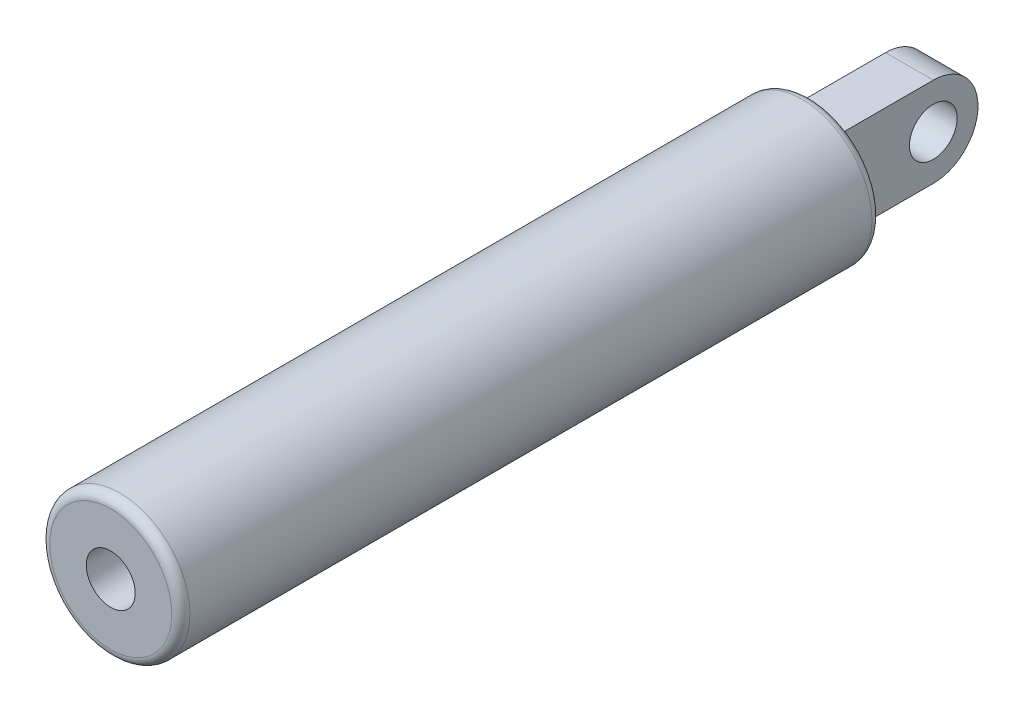
ISO-10303-21;
HEADER;
FILE_DESCRIPTION(('STEP AP214'),'2;1');
FILE_NAME('part.step','',(''),(''),'','','');
FILE_SCHEMA(('AUTOMOTIVE_DESIGN { 1 0 10303 214 1 1 1 1 }'));
ENDSEC;
DATA;
#1=APPLICATION_CONTEXT('core data for automotive mechanical design processes');
#2=APPLICATION_PROTOCOL_DEFINITION('international standard','automotive_design',2000,#1);
#3=PRODUCT_CONTEXT('',#1,'mechanical');
#4=PRODUCT('Part','Part','',(#3));
#5=PRODUCT_RELATED_PRODUCT_CATEGORY('part','',(#4));
#6=PRODUCT_DEFINITION_FORMATION('','',#4);
#7=PRODUCT_DEFINITION_CONTEXT('part definition',#1,'design');
#8=PRODUCT_DEFINITION('design','',#6,#7);
#9=PRODUCT_DEFINITION_SHAPE('','',#8);
#10=(LENGTH_UNIT() NAMED_UNIT(*) SI_UNIT(.MILLI.,.METRE.));
#11=(NAMED_UNIT(*) PLANE_ANGLE_UNIT() SI_UNIT($,.RADIAN.));
#12=(NAMED_UNIT(*) SI_UNIT($,.STERADIAN.) SOLID_ANGLE_UNIT());
#13=UNCERTAINTY_MEASURE_WITH_UNIT(LENGTH_MEASURE(1.E-05),#10,'distance_accuracy_value','');
#14=(GEOMETRIC_REPRESENTATION_CONTEXT(3) GLOBAL_UNCERTAINTY_ASSIGNED_CONTEXT((#13)) GLOBAL_UNIT_ASSIGNED_CONTEXT((#10,
#11,#12)) REPRESENTATION_CONTEXT('',''));
#15=CARTESIAN_POINT('',(0.,0.,0.));
#16=DIRECTION('',(0.,0.,1.));
#17=DIRECTION('',(1.,0.,0.));
#18=AXIS2_PLACEMENT_3D('',#15,#16,#17);
#19=CARTESIAN_POINT('',(0.,0.,-46.609));
#20=DIRECTION('',(0.,0.,1.));
#21=DIRECTION('',(1.,0.,0.));
#22=AXIS2_PLACEMENT_3D('',#19,#20,#21);
#23=PLANE('',#22);
#24=CARTESIAN_POINT('',(0.,0.,-46.609));
#25=DIRECTION('',(0.,0.,1.));
#26=DIRECTION('',(1.,0.,0.));
#27=AXIS2_PLACEMENT_3D('',#24,#25,#26);
#28=CIRCLE('',#27,5.19176);
#29=CARTESIAN_POINT('',(5.19176,0.,-46.609));
#30=VERTEX_POINT('',#29);
#31=EDGE_CURVE('E43',#30,#30,#28,.F.);
#32=ORIENTED_EDGE('',*,*,#31,.T.);
#33=EDGE_LOOP('',(#32));
#34=FACE_BOUND('',#33,.T.);
#35=DIRECTION('',(-1.,0.,0.));
#36=VECTOR('',#35,1.);
#37=CARTESIAN_POINT('',(2.032,-3.81,-46.609));
#38=LINE('',#37,#36);
#39=CARTESIAN_POINT('',(2.032,-3.81,-46.609));
#40=VERTEX_POINT('',#39);
#41=CARTESIAN_POINT('',(-2.032,-3.81,-46.609));
#42=VERTEX_POINT('',#41);
#43=EDGE_CURVE('E50',#40,#42,#38,.T.);
#44=ORIENTED_EDGE('',*,*,#43,.F.);
#45=DIRECTION('',(0.,-1.,0.));
#46=VECTOR('',#45,1.);
#47=CARTESIAN_POINT('',(2.032,-3.81,-46.609));
#48=LINE('',#47,#46);
#49=CARTESIAN_POINT('',(2.032,3.81,-46.609));
#50=VERTEX_POINT('',#49);
#51=EDGE_CURVE('E82',#50,#40,#48,.T.);
#52=ORIENTED_EDGE('',*,*,#51,.F.);
#53=DIRECTION('',(-1.,0.,0.));
#54=VECTOR('',#53,1.);
#55=CARTESIAN_POINT('',(2.032,3.81,-46.609));
#56=LINE('',#55,#54);
#57=CARTESIAN_POINT('',(-2.032,3.81,-46.609));
#58=VERTEX_POINT('',#57);
#59=EDGE_CURVE('E98',#50,#58,#56,.T.);
#60=ORIENTED_EDGE('',*,*,#59,.T.);
#61=DIRECTION('',(0.,-1.,0.));
#62=VECTOR('',#61,1.);
#63=CARTESIAN_POINT('',(-2.032,-3.81,-46.609));
#64=LINE('',#63,#62);
#65=EDGE_CURVE('E55',#58,#42,#64,.T.);
#66=ORIENTED_EDGE('',*,*,#65,.T.);
#67=EDGE_LOOP('',(#44,#52,#60,#66));
#68=FACE_BOUND('',#67,.T.);
#69=ADVANCED_FACE('F35',(#34,#68),#23,.F.);
#70=CARTESIAN_POINT('',(0.,0.,54.991));
#71=DIRECTION('',(0.,0.,1.));
#72=DIRECTION('',(1.,0.,0.));
#73=AXIS2_PLACEMENT_3D('',#70,#71,#72);
#74=CYLINDRICAL_SURFACE('',#73,5.969);
#75=CARTESIAN_POINT('',(0.,0.,-45.83176));
#76=DIRECTION('',(0.,0.,1.));
#77=DIRECTION('',(1.,0.,0.));
#78=AXIS2_PLACEMENT_3D('',#75,#76,#77);
#79=CIRCLE('',#78,5.969);
#80=CARTESIAN_POINT('',(5.969,0.,-45.83176));
#81=VERTEX_POINT('',#80);
#82=EDGE_CURVE('E122',#81,#81,#79,.T.);
#83=ORIENTED_EDGE('',*,*,#82,.T.);
#84=EDGE_LOOP('',(#83));
#85=FACE_BOUND('',#84,.T.);
#86=CARTESIAN_POINT('',(0.,0.,12.25296));
#87=DIRECTION('',(0.,0.,-1.));
#88=DIRECTION('',(-1.,0.,0.));
#89=AXIS2_PLACEMENT_3D('',#86,#87,#88);
#90=CIRCLE('',#89,5.969);
#91=CARTESIAN_POINT('',(-5.969,0.,12.25296));
#92=VERTEX_POINT('',#91);
#93=EDGE_CURVE('E119',#92,#92,#90,.T.);
#94=ORIENTED_EDGE('',*,*,#93,.T.);
#95=EDGE_LOOP('',(#94));
#96=FACE_BOUND('',#95,.T.);
#97=ADVANCED_FACE('F134',(#85,#96),#74,.T.);
#98=CARTESIAN_POINT('',(0.,2.0828,13.0302));
#99=DIRECTION('',(0.,0.,-1.));
#100=DIRECTION('',(-1.,0.,0.));
#101=AXIS2_PLACEMENT_3D('',#98,#99,#100);
#102=PLANE('',#101);
#103=CARTESIAN_POINT('',(0.,0.,13.0302));
#104=DIRECTION('',(0.,0.,-1.));
#105=DIRECTION('',(-1.,0.,0.));
#106=AXIS2_PLACEMENT_3D('',#103,#104,#105);
#107=CIRCLE('',#106,5.19176);
#108=CARTESIAN_POINT('',(-5.19176,0.,13.0302));
#109=VERTEX_POINT('',#108);
#110=EDGE_CURVE('E12',#109,#109,#107,.F.);
#111=ORIENTED_EDGE('',*,*,#110,.T.);
#112=EDGE_LOOP('',(#111));
#113=FACE_BOUND('',#112,.T.);
#114=CARTESIAN_POINT('',(0.,0.,13.0302));
#115=DIRECTION('',(0.,0.,1.));
#116=DIRECTION('',(1.,0.,0.));
#117=AXIS2_PLACEMENT_3D('',#114,#115,#116);
#118=CIRCLE('',#117,2.0828);
#119=CARTESIAN_POINT('',(2.0828,0.,13.0302));
#120=VERTEX_POINT('',#119);
#121=EDGE_CURVE('E116',#120,#120,#118,.T.);
#122=ORIENTED_EDGE('',*,*,#121,.F.);
#123=EDGE_LOOP('',(#122));
#124=FACE_BOUND('',#123,.T.);
#125=ADVANCED_FACE('F137',(#113,#124),#102,.F.);
#126=CARTESIAN_POINT('',(0.,0.,54.991));
#127=DIRECTION('',(0.,0.,1.));
#128=DIRECTION('',(1.,0.,0.));
#129=AXIS2_PLACEMENT_3D('',#126,#127,#128);
#130=CYLINDRICAL_SURFACE('',#129,2.0828);
#131=CARTESIAN_POINT('',(0.,0.,-29.1846));
#132=DIRECTION('',(0.,0.,1.));
#133=DIRECTION('',(1.,0.,0.));
#134=AXIS2_PLACEMENT_3D('',#131,#132,#133);
#135=CIRCLE('',#134,2.0828);
#136=CARTESIAN_POINT('',(2.0828,0.,-29.1846));
#137=VERTEX_POINT('',#136);
#138=EDGE_CURVE('E113',#137,#137,#135,.T.);
#139=ORIENTED_EDGE('',*,*,#138,.F.);
#140=EDGE_LOOP('',(#139));
#141=FACE_BOUND('',#140,.T.);
#142=ORIENTED_EDGE('',*,*,#121,.T.);
#143=EDGE_LOOP('',(#142));
#144=FACE_BOUND('',#143,.T.);
#145=ADVANCED_FACE('F147',(#141,#144),#130,.F.);
#146=CARTESIAN_POINT('',(0.,2.0828,-29.1846));
#147=DIRECTION('',(0.,0.,-1.));
#148=DIRECTION('',(-1.,0.,0.));
#149=AXIS2_PLACEMENT_3D('',#146,#147,#148);
#150=PLANE('',#149);
#151=ORIENTED_EDGE('',*,*,#138,.T.);
#152=EDGE_LOOP('',(#151));
#153=FACE_BOUND('',#152,.T.);
#154=ADVANCED_FACE('F131',(#153),#150,.F.);
#155=CARTESIAN_POINT('',(0.,0.,-45.83176));
#156=DIRECTION('',(0.,0.,1.));
#157=DIRECTION('',(1.,0.,0.));
#158=AXIS2_PLACEMENT_3D('',#155,#156,#157);
#159=TOROIDAL_SURFACE('',#158,5.19176,0.77724);
#160=ORIENTED_EDGE('',*,*,#31,.F.);
#161=EDGE_LOOP('',(#160));
#162=FACE_BOUND('',#161,.T.);
#163=ORIENTED_EDGE('',*,*,#82,.F.);
#164=EDGE_LOOP('',(#163));
#165=FACE_BOUND('',#164,.T.);
#166=ADVANCED_FACE('F128',(#162,#165),#159,.T.);
#167=CARTESIAN_POINT('',(0.,0.,12.25296));
#168=DIRECTION('',(0.,0.,-1.));
#169=DIRECTION('',(-1.,0.,0.));
#170=AXIS2_PLACEMENT_3D('',#167,#168,#169);
#171=TOROIDAL_SURFACE('',#170,5.19176,0.77724);
#172=ORIENTED_EDGE('',*,*,#93,.F.);
#173=EDGE_LOOP('',(#172));
#174=FACE_BOUND('',#173,.T.);
#175=ORIENTED_EDGE('',*,*,#110,.F.);
#176=EDGE_LOOP('',(#175));
#177=FACE_BOUND('',#176,.T.);
#178=ADVANCED_FACE('F37',(#174,#177),#171,.T.);
#179=CARTESIAN_POINT('',(2.032,0.,-54.991));
#180=DIRECTION('',(-1.,0.,0.));
#181=DIRECTION('',(0.,0.,1.));
#182=AXIS2_PLACEMENT_3D('',#179,#180,#181);
#183=PLANE('',#182);
#184=ORIENTED_EDGE('',*,*,#51,.T.);
#185=DIRECTION('',(0.,0.,-1.));
#186=VECTOR('',#185,1.);
#187=CARTESIAN_POINT('',(2.032,-3.81,-46.609));
#188=LINE('',#187,#186);
#189=CARTESIAN_POINT('',(2.032,-3.81,-54.991));
#190=VERTEX_POINT('',#189);
#191=EDGE_CURVE('E74',#40,#190,#188,.T.);
#192=ORIENTED_EDGE('',*,*,#191,.T.);
#193=CARTESIAN_POINT('',(2.032,0.,-54.991));
#194=DIRECTION('',(1.,0.,0.));
#195=DIRECTION('',(0.,0.,1.));
#196=AXIS2_PLACEMENT_3D('',#193,#194,#195);
#197=CIRCLE('',#196,3.81);
#198=CARTESIAN_POINT('',(2.032,3.81,-54.991));
#199=VERTEX_POINT('',#198);
#200=EDGE_CURVE('E80',#190,#199,#197,.T.);
#201=ORIENTED_EDGE('',*,*,#200,.T.);
#202=DIRECTION('',(0.,0.,1.));
#203=VECTOR('',#202,1.);
#204=CARTESIAN_POINT('',(2.032,3.81,-46.609));
#205=LINE('',#204,#203);
#206=EDGE_CURVE('E96',#199,#50,#205,.T.);
#207=ORIENTED_EDGE('',*,*,#206,.T.);
#208=EDGE_LOOP('',(#184,#192,#201,#207));
#209=FACE_BOUND('',#208,.T.);
#210=CARTESIAN_POINT('',(2.032,0.,-54.991));
#211=DIRECTION('',(1.,0.,0.));
#212=DIRECTION('',(0.,0.,-1.));
#213=AXIS2_PLACEMENT_3D('',#210,#211,#212);
#214=CIRCLE('',#213,2.03199999999998);
#215=CARTESIAN_POINT('',(2.032,0.,-57.023));
#216=VERTEX_POINT('',#215);
#217=EDGE_CURVE('E103',#216,#216,#214,.T.);
#218=ORIENTED_EDGE('',*,*,#217,.F.);
#219=EDGE_LOOP('',(#218));
#220=FACE_BOUND('',#219,.T.);
#221=ADVANCED_FACE('F76',(#209,#220),#183,.F.);
#222=CARTESIAN_POINT('',(-2.032,0.,-54.991));
#223=DIRECTION('',(-1.,0.,0.));
#224=DIRECTION('',(0.,0.,1.));
#225=AXIS2_PLACEMENT_3D('',#222,#223,#224);
#226=PLANE('',#225);
#227=ORIENTED_EDGE('',*,*,#65,.F.);
#228=DIRECTION('',(0.,0.,1.));
#229=VECTOR('',#228,1.);
#230=CARTESIAN_POINT('',(-2.032,3.81,-46.609));
#231=LINE('',#230,#229);
#232=CARTESIAN_POINT('',(-2.032,3.81,-54.991));
#233=VERTEX_POINT('',#232);
#234=EDGE_CURVE('E107',#233,#58,#231,.T.);
#235=ORIENTED_EDGE('',*,*,#234,.F.);
#236=CARTESIAN_POINT('',(-2.032,0.,-54.991));
#237=DIRECTION('',(1.,0.,0.));
#238=DIRECTION('',(0.,0.,1.));
#239=AXIS2_PLACEMENT_3D('',#236,#237,#238);
#240=CIRCLE('',#239,3.81);
#241=CARTESIAN_POINT('',(-2.032,-3.81,-54.991));
#242=VERTEX_POINT('',#241);
#243=EDGE_CURVE('E105',#242,#233,#240,.T.);
#244=ORIENTED_EDGE('',*,*,#243,.F.);
#245=DIRECTION('',(0.,0.,-1.));
#246=VECTOR('',#245,1.);
#247=CARTESIAN_POINT('',(-2.032,-3.81,-46.609));
#248=LINE('',#247,#246);
#249=EDGE_CURVE('E88',#42,#242,#248,.T.);
#250=ORIENTED_EDGE('',*,*,#249,.F.);
#251=EDGE_LOOP('',(#227,#235,#244,#250));
#252=FACE_BOUND('',#251,.T.);
#253=CARTESIAN_POINT('',(-2.032,0.,-54.991));
#254=DIRECTION('',(1.,0.,0.));
#255=DIRECTION('',(0.,0.,-1.));
#256=AXIS2_PLACEMENT_3D('',#253,#254,#255);
#257=CIRCLE('',#256,2.03199999999998);
#258=CARTESIAN_POINT('',(-2.032,0.,-57.023));
#259=VERTEX_POINT('',#258);
#260=EDGE_CURVE('E252',#259,#259,#257,.T.);
#261=ORIENTED_EDGE('',*,*,#260,.T.);
#262=EDGE_LOOP('',(#261));
#263=FACE_BOUND('',#262,.T.);
#264=ADVANCED_FACE('F195',(#252,#263),#226,.T.);
#265=CARTESIAN_POINT('',(2.032,-3.81,-46.609));
#266=DIRECTION('',(0.,1.,0.));
#267=DIRECTION('',(0.,0.,1.));
#268=AXIS2_PLACEMENT_3D('',#265,#266,#267);
#269=PLANE('',#268);
#270=ORIENTED_EDGE('',*,*,#249,.T.);
#271=DIRECTION('',(-1.,0.,0.));
#272=VECTOR('',#271,1.);
#273=CARTESIAN_POINT('',(2.032,-3.81,-54.991));
#274=LINE('',#273,#272);
#275=EDGE_CURVE('E86',#190,#242,#274,.T.);
#276=ORIENTED_EDGE('',*,*,#275,.F.);
#277=ORIENTED_EDGE('',*,*,#191,.F.);
#278=ORIENTED_EDGE('',*,*,#43,.T.);
#279=EDGE_LOOP('',(#270,#276,#277,#278));
#280=FACE_BOUND('',#279,.T.);
#281=ADVANCED_FACE('F87',(#280),#269,.F.);
#282=CARTESIAN_POINT('',(2.032,0.,-54.991));
#283=DIRECTION('',(-1.,0.,0.));
#284=DIRECTION('',(0.,0.,1.));
#285=AXIS2_PLACEMENT_3D('',#282,#283,#284);
#286=CYLINDRICAL_SURFACE('',#285,3.81);
#287=ORIENTED_EDGE('',*,*,#243,.T.);
#288=DIRECTION('',(-1.,0.,0.));
#289=VECTOR('',#288,1.);
#290=CARTESIAN_POINT('',(2.032,3.81,-54.991));
#291=LINE('',#290,#289);
#292=EDGE_CURVE('E91',#199,#233,#291,.T.);
#293=ORIENTED_EDGE('',*,*,#292,.F.);
#294=ORIENTED_EDGE('',*,*,#200,.F.);
#295=ORIENTED_EDGE('',*,*,#275,.T.);
#296=EDGE_LOOP('',(#287,#293,#294,#295));
#297=FACE_BOUND('',#296,.T.);
#298=ADVANCED_FACE('F93',(#297),#286,.T.);
#299=CARTESIAN_POINT('',(2.032,3.81,-46.609));
#300=DIRECTION('',(0.,-1.,0.));
#301=DIRECTION('',(0.,0.,-1.));
#302=AXIS2_PLACEMENT_3D('',#299,#300,#301);
#303=PLANE('',#302);
#304=ORIENTED_EDGE('',*,*,#234,.T.);
#305=ORIENTED_EDGE('',*,*,#59,.F.);
#306=ORIENTED_EDGE('',*,*,#206,.F.);
#307=ORIENTED_EDGE('',*,*,#292,.T.);
#308=EDGE_LOOP('',(#304,#305,#306,#307));
#309=FACE_BOUND('',#308,.T.);
#310=ADVANCED_FACE('F215',(#309),#303,.F.);
#311=CARTESIAN_POINT('',(2.032,0.,-54.991));
#312=DIRECTION('',(-1.,0.,0.));
#313=DIRECTION('',(0.,0.,1.));
#314=AXIS2_PLACEMENT_3D('',#311,#312,#313);
#315=CYLINDRICAL_SURFACE('',#314,2.03199999999998);
#316=ORIENTED_EDGE('',*,*,#217,.T.);
#317=EDGE_LOOP('',(#316));
#318=FACE_BOUND('',#317,.T.);
#319=ORIENTED_EDGE('',*,*,#260,.F.);
#320=EDGE_LOOP('',(#319));
#321=FACE_BOUND('',#320,.T.);
#322=ADVANCED_FACE('F222',(#318,#321),#315,.F.);
#323=CLOSED_SHELL('',(#69,#97,#125,#145,#154,#166,#178,#221,#264,#281,#298,#310,#322));
#324=MANIFOLD_SOLID_BREP('B2',#323);
#325=ADVANCED_BREP_SHAPE_REPRESENTATION('',(#18,#324),#14);
#326=SHAPE_DEFINITION_REPRESENTATION(#9,#325);
ENDSEC;
END-ISO-10303-21;
